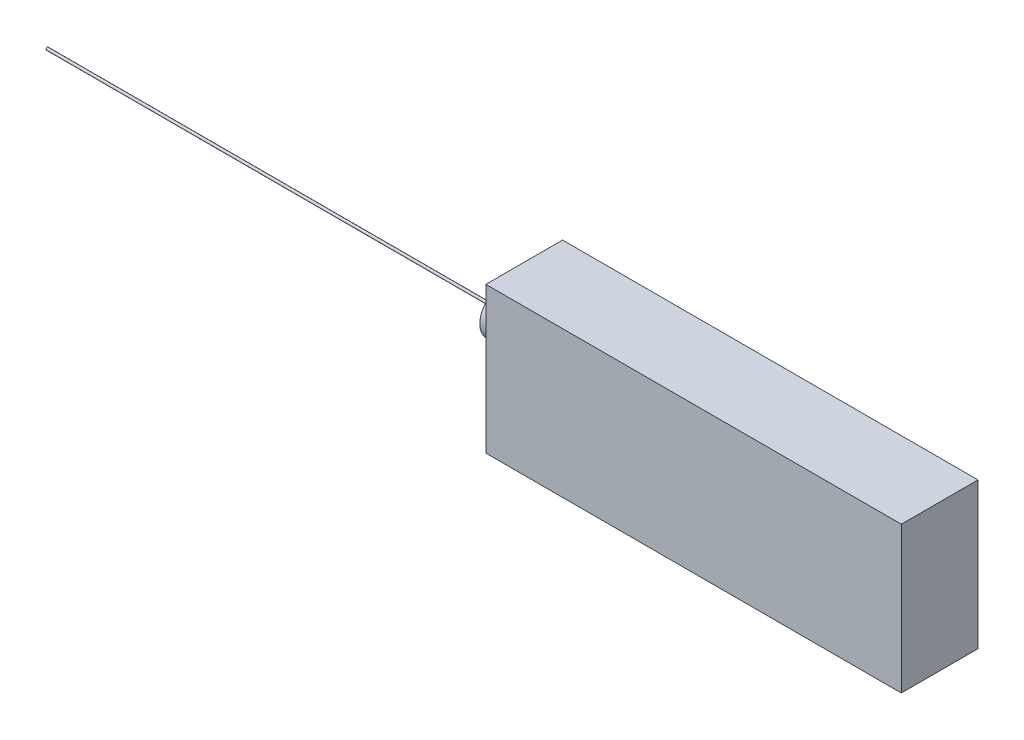
ISO-10303-21;
HEADER;
FILE_DESCRIPTION(('STEP AP214'),'2;1');
FILE_NAME('part.step','',(''),(''),'','','');
FILE_SCHEMA(('AUTOMOTIVE_DESIGN { 1 0 10303 214 1 1 1 1 }'));
ENDSEC;
DATA;
#1=APPLICATION_CONTEXT('core data for automotive mechanical design processes');
#2=APPLICATION_PROTOCOL_DEFINITION('international standard','automotive_design',2000,#1);
#3=PRODUCT_CONTEXT('',#1,'mechanical');
#4=PRODUCT('Part','Part','',(#3));
#5=PRODUCT_RELATED_PRODUCT_CATEGORY('part','',(#4));
#6=PRODUCT_DEFINITION_FORMATION('','',#4);
#7=PRODUCT_DEFINITION_CONTEXT('part definition',#1,'design');
#8=PRODUCT_DEFINITION('design','',#6,#7);
#9=PRODUCT_DEFINITION_SHAPE('','',#8);
#10=(LENGTH_UNIT() NAMED_UNIT(*) SI_UNIT(.MILLI.,.METRE.));
#11=(NAMED_UNIT(*) PLANE_ANGLE_UNIT() SI_UNIT($,.RADIAN.));
#12=(NAMED_UNIT(*) SI_UNIT($,.STERADIAN.) SOLID_ANGLE_UNIT());
#13=UNCERTAINTY_MEASURE_WITH_UNIT(LENGTH_MEASURE(1.E-05),#10,'distance_accuracy_value','');
#14=(GEOMETRIC_REPRESENTATION_CONTEXT(3) GLOBAL_UNCERTAINTY_ASSIGNED_CONTEXT((#13)) GLOBAL_UNIT_ASSIGNED_CONTEXT((#10,
#11,#12)) REPRESENTATION_CONTEXT('',''));
#15=CARTESIAN_POINT('',(0.,0.,0.));
#16=DIRECTION('',(0.,0.,1.));
#17=DIRECTION('',(1.,0.,0.));
#18=AXIS2_PLACEMENT_3D('',#15,#16,#17);
#19=CARTESIAN_POINT('',(162.5,-114.37,-30.));
#20=DIRECTION('',(1.,0.,0.));
#21=DIRECTION('',(0.,0.,-1.));
#22=AXIS2_PLACEMENT_3D('',#19,#20,#21);
#23=PLANE('',#22);
#24=DIRECTION('',(0.,0.,-1.));
#25=VECTOR('',#24,1.);
#26=CARTESIAN_POINT('',(162.5,0.,-30.));
#27=LINE('',#26,#25);
#28=CARTESIAN_POINT('',(162.5,0.,30.));
#29=VERTEX_POINT('',#28);
#30=CARTESIAN_POINT('',(162.5,0.,-30.));
#31=VERTEX_POINT('',#30);
#32=EDGE_CURVE('E123',#29,#31,#27,.T.);
#33=ORIENTED_EDGE('',*,*,#32,.F.);
#34=DIRECTION('',(0.,1.,0.));
#35=VECTOR('',#34,1.);
#36=CARTESIAN_POINT('',(162.5,-114.37,30.));
#37=LINE('',#36,#35);
#38=CARTESIAN_POINT('',(162.5,-114.37,30.));
#39=VERTEX_POINT('',#38);
#40=EDGE_CURVE('E61',#39,#29,#37,.T.);
#41=ORIENTED_EDGE('',*,*,#40,.F.);
#42=DIRECTION('',(0.,0.,-1.));
#43=VECTOR('',#42,1.);
#44=CARTESIAN_POINT('',(162.5,-114.37,-30.));
#45=LINE('',#44,#43);
#46=CARTESIAN_POINT('',(162.5,-114.37,-30.));
#47=VERTEX_POINT('',#46);
#48=EDGE_CURVE('E115',#39,#47,#45,.T.);
#49=ORIENTED_EDGE('',*,*,#48,.T.);
#50=DIRECTION('',(0.,1.,0.));
#51=VECTOR('',#50,1.);
#52=CARTESIAN_POINT('',(162.5,-114.37,-30.));
#53=LINE('',#52,#51);
#54=EDGE_CURVE('E54',#47,#31,#53,.T.);
#55=ORIENTED_EDGE('',*,*,#54,.T.);
#56=EDGE_LOOP('',(#33,#41,#49,#55));
#57=FACE_BOUND('',#56,.T.);
#58=ADVANCED_FACE('F51',(#57),#23,.T.);
#59=CARTESIAN_POINT('',(-162.5,-114.37,30.));
#60=DIRECTION('',(0.,0.,1.));
#61=DIRECTION('',(1.,0.,0.));
#62=AXIS2_PLACEMENT_3D('',#59,#60,#61);
#63=PLANE('',#62);
#64=DIRECTION('',(1.,0.,0.));
#65=VECTOR('',#64,1.);
#66=CARTESIAN_POINT('',(-162.5,0.,30.));
#67=LINE('',#66,#65);
#68=CARTESIAN_POINT('',(-162.5,0.,30.));
#69=VERTEX_POINT('',#68);
#70=EDGE_CURVE('E118',#69,#29,#67,.T.);
#71=ORIENTED_EDGE('',*,*,#70,.F.);
#72=DIRECTION('',(0.,1.,0.));
#73=VECTOR('',#72,1.);
#74=CARTESIAN_POINT('',(-162.5,-114.37,30.));
#75=LINE('',#74,#73);
#76=CARTESIAN_POINT('',(-162.5,-114.37,30.));
#77=VERTEX_POINT('',#76);
#78=EDGE_CURVE('E86',#77,#69,#75,.T.);
#79=ORIENTED_EDGE('',*,*,#78,.F.);
#80=DIRECTION('',(1.,0.,0.));
#81=VECTOR('',#80,1.);
#82=CARTESIAN_POINT('',(-162.5,-114.37,30.));
#83=LINE('',#82,#81);
#84=EDGE_CURVE('E110',#77,#39,#83,.T.);
#85=ORIENTED_EDGE('',*,*,#84,.T.);
#86=ORIENTED_EDGE('',*,*,#40,.T.);
#87=EDGE_LOOP('',(#71,#79,#85,#86));
#88=FACE_BOUND('',#87,.T.);
#89=ADVANCED_FACE('F142',(#88),#63,.T.);
#90=CARTESIAN_POINT('',(-162.5,-114.37,-30.));
#91=DIRECTION('',(-1.,0.,0.));
#92=DIRECTION('',(0.,0.,1.));
#93=AXIS2_PLACEMENT_3D('',#90,#91,#92);
#94=PLANE('',#93);
#95=CARTESIAN_POINT('',(-162.5,-49.37,-7.50000000000001));
#96=DIRECTION('',(-1.,0.,0.));
#97=DIRECTION('',(0.,0.,1.));
#98=AXIS2_PLACEMENT_3D('',#95,#96,#97);
#99=CIRCLE('',#98,17.2386689446734);
#100=CARTESIAN_POINT('',(-162.5,-49.37,9.73866894467334));
#101=VERTEX_POINT('',#100);
#102=EDGE_CURVE('E11',#101,#101,#99,.T.);
#103=ORIENTED_EDGE('',*,*,#102,.F.);
#104=EDGE_LOOP('',(#103));
#105=FACE_BOUND('',#104,.T.);
#106=DIRECTION('',(0.,0.,1.));
#107=VECTOR('',#106,1.);
#108=CARTESIAN_POINT('',(-162.5,0.,-30.));
#109=LINE('',#108,#107);
#110=CARTESIAN_POINT('',(-162.5,0.,-30.));
#111=VERTEX_POINT('',#110);
#112=EDGE_CURVE('E104',#111,#69,#109,.T.);
#113=ORIENTED_EDGE('',*,*,#112,.F.);
#114=DIRECTION('',(0.,1.,0.));
#115=VECTOR('',#114,1.);
#116=CARTESIAN_POINT('',(-162.5,-114.37,-30.));
#117=LINE('',#116,#115);
#118=CARTESIAN_POINT('',(-162.5,-114.37,-30.));
#119=VERTEX_POINT('',#118);
#120=EDGE_CURVE('E99',#119,#111,#117,.T.);
#121=ORIENTED_EDGE('',*,*,#120,.F.);
#122=DIRECTION('',(0.,0.,1.));
#123=VECTOR('',#122,1.);
#124=CARTESIAN_POINT('',(-162.5,-114.37,-30.));
#125=LINE('',#124,#123);
#126=EDGE_CURVE('E102',#119,#77,#125,.T.);
#127=ORIENTED_EDGE('',*,*,#126,.T.);
#128=ORIENTED_EDGE('',*,*,#78,.T.);
#129=EDGE_LOOP('',(#113,#121,#127,#128));
#130=FACE_BOUND('',#129,.T.);
#131=ADVANCED_FACE('F101',(#105,#130),#94,.T.);
#132=CARTESIAN_POINT('',(-162.5,-114.37,-30.));
#133=DIRECTION('',(0.,0.,-1.));
#134=DIRECTION('',(-1.,0.,0.));
#135=AXIS2_PLACEMENT_3D('',#132,#133,#134);
#136=PLANE('',#135);
#137=DIRECTION('',(-1.,0.,0.));
#138=VECTOR('',#137,1.);
#139=CARTESIAN_POINT('',(-162.5,0.,-30.));
#140=LINE('',#139,#138);
#141=EDGE_CURVE('E127',#31,#111,#140,.T.);
#142=ORIENTED_EDGE('',*,*,#141,.F.);
#143=ORIENTED_EDGE('',*,*,#54,.F.);
#144=DIRECTION('',(-1.,0.,0.));
#145=VECTOR('',#144,1.);
#146=CARTESIAN_POINT('',(-162.5,-114.37,-30.));
#147=LINE('',#146,#145);
#148=EDGE_CURVE('E109',#47,#119,#147,.T.);
#149=ORIENTED_EDGE('',*,*,#148,.T.);
#150=ORIENTED_EDGE('',*,*,#120,.T.);
#151=EDGE_LOOP('',(#142,#143,#149,#150));
#152=FACE_BOUND('',#151,.T.);
#153=ADVANCED_FACE('F113',(#152),#136,.T.);
#154=CARTESIAN_POINT('',(0.,-114.37,0.));
#155=DIRECTION('',(0.,1.,0.));
#156=DIRECTION('',(0.,0.,1.));
#157=AXIS2_PLACEMENT_3D('',#154,#155,#156);
#158=PLANE('',#157);
#159=ORIENTED_EDGE('',*,*,#48,.F.);
#160=ORIENTED_EDGE('',*,*,#84,.F.);
#161=ORIENTED_EDGE('',*,*,#126,.F.);
#162=ORIENTED_EDGE('',*,*,#148,.F.);
#163=EDGE_LOOP('',(#159,#160,#161,#162));
#164=FACE_BOUND('',#163,.T.);
#165=ADVANCED_FACE('F108',(#164),#158,.F.);
#166=CARTESIAN_POINT('',(0.,0.,0.));
#167=DIRECTION('',(0.,1.,0.));
#168=DIRECTION('',(0.,0.,1.));
#169=AXIS2_PLACEMENT_3D('',#166,#167,#168);
#170=PLANE('',#169);
#171=ORIENTED_EDGE('',*,*,#32,.T.);
#172=ORIENTED_EDGE('',*,*,#141,.T.);
#173=ORIENTED_EDGE('',*,*,#112,.T.);
#174=ORIENTED_EDGE('',*,*,#70,.T.);
#175=EDGE_LOOP('',(#171,#172,#173,#174));
#176=FACE_BOUND('',#175,.T.);
#177=ADVANCED_FACE('F141',(#176),#170,.T.);
#178=CARTESIAN_POINT('',(-187.5,-49.37,-7.5));
#179=DIRECTION('',(1.,0.,0.));
#180=DIRECTION('',(0.,0.,-1.));
#181=AXIS2_PLACEMENT_3D('',#178,#179,#180);
#182=CYLINDRICAL_SURFACE('',#181,17.2386689446734);
#183=CARTESIAN_POINT('',(-187.5,-49.37,-7.5));
#184=DIRECTION('',(-1.,0.,0.));
#185=DIRECTION('',(0.,0.,1.));
#186=AXIS2_PLACEMENT_3D('',#183,#184,#185);
#187=CIRCLE('',#186,17.2386689446734);
#188=CARTESIAN_POINT('',(-187.5,-49.37,9.73866894467335));
#189=VERTEX_POINT('',#188);
#190=EDGE_CURVE('E128',#189,#189,#187,.T.);
#191=ORIENTED_EDGE('',*,*,#190,.F.);
#192=EDGE_LOOP('',(#191));
#193=FACE_BOUND('',#192,.T.);
#194=ORIENTED_EDGE('',*,*,#102,.T.);
#195=EDGE_LOOP('',(#194));
#196=FACE_BOUND('',#195,.T.);
#197=ADVANCED_FACE('F160',(#193,#196),#182,.T.);
#198=CARTESIAN_POINT('',(-187.5,-49.37,-7.5));
#199=DIRECTION('',(-1.,0.,0.));
#200=DIRECTION('',(0.,0.,1.));
#201=AXIS2_PLACEMENT_3D('',#198,#199,#200);
#202=PLANE('',#201);
#203=CARTESIAN_POINT('',(-187.5,-49.37,-7.5));
#204=DIRECTION('',(-1.,0.,0.));
#205=DIRECTION('',(0.,0.,1.));
#206=AXIS2_PLACEMENT_3D('',#203,#204,#205);
#207=CIRCLE('',#206,1.);
#208=CARTESIAN_POINT('',(-187.5,-49.37,-6.5));
#209=VERTEX_POINT('',#208);
#210=EDGE_CURVE('E183',#209,#209,#207,.T.);
#211=ORIENTED_EDGE('',*,*,#210,.F.);
#212=EDGE_LOOP('',(#211));
#213=FACE_BOUND('',#212,.T.);
#214=ORIENTED_EDGE('',*,*,#190,.T.);
#215=EDGE_LOOP('',(#214));
#216=FACE_BOUND('',#215,.T.);
#217=ADVANCED_FACE('F164',(#213,#216),#202,.T.);
#218=CARTESIAN_POINT('',(-543.1,-49.37,-7.49999999999984));
#219=DIRECTION('',(1.,0.,0.));
#220=DIRECTION('',(0.,0.,-1.));
#221=AXIS2_PLACEMENT_3D('',#218,#219,#220);
#222=CYLINDRICAL_SURFACE('',#221,1.);
#223=CARTESIAN_POINT('',(-543.1,-49.37,-7.49999999999984));
#224=DIRECTION('',(-1.,0.,0.));
#225=DIRECTION('',(0.,0.,1.));
#226=AXIS2_PLACEMENT_3D('',#223,#224,#225);
#227=CIRCLE('',#226,1.);
#228=CARTESIAN_POINT('',(-543.1,-49.37,-6.49999999999984));
#229=VERTEX_POINT('',#228);
#230=EDGE_CURVE('E181',#229,#229,#227,.T.);
#231=ORIENTED_EDGE('',*,*,#230,.F.);
#232=EDGE_LOOP('',(#231));
#233=FACE_BOUND('',#232,.T.);
#234=ORIENTED_EDGE('',*,*,#210,.T.);
#235=EDGE_LOOP('',(#234));
#236=FACE_BOUND('',#235,.T.);
#237=ADVANCED_FACE('F168',(#233,#236),#222,.T.);
#238=CARTESIAN_POINT('',(-543.1,-49.37,-7.49999999999984));
#239=DIRECTION('',(-1.,0.,0.));
#240=DIRECTION('',(0.,0.,1.));
#241=AXIS2_PLACEMENT_3D('',#238,#239,#240);
#242=PLANE('',#241);
#243=ORIENTED_EDGE('',*,*,#230,.T.);
#244=EDGE_LOOP('',(#243));
#245=FACE_BOUND('',#244,.T.);
#246=ADVANCED_FACE('F172',(#245),#242,.T.);
#247=CLOSED_SHELL('',(#58,#89,#131,#153,#165,#177,#197,#217,#237,#246));
#248=MANIFOLD_SOLID_BREP('B2',#247);
#249=ADVANCED_BREP_SHAPE_REPRESENTATION('',(#18,#248),#14);
#250=SHAPE_DEFINITION_REPRESENTATION(#9,#249);
ENDSEC;
END-ISO-10303-21;
